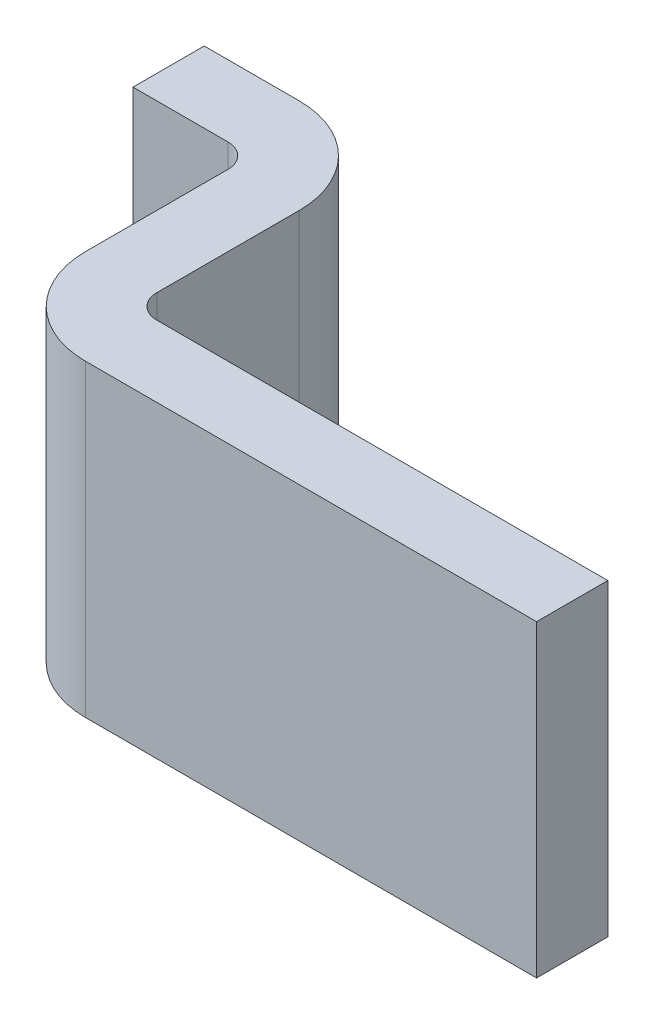
ISO-10303-21;
HEADER;
FILE_DESCRIPTION(('STEP AP214'),'2;1');
FILE_NAME('part.step','',(''),(''),'','','');
FILE_SCHEMA(('AUTOMOTIVE_DESIGN { 1 0 10303 214 1 1 1 1 }'));
ENDSEC;
DATA;
#1=APPLICATION_CONTEXT('core data for automotive mechanical design processes');
#2=APPLICATION_PROTOCOL_DEFINITION('international standard','automotive_design',2000,#1);
#3=PRODUCT_CONTEXT('',#1,'mechanical');
#4=PRODUCT('Part','Part','',(#3));
#5=PRODUCT_RELATED_PRODUCT_CATEGORY('part','',(#4));
#6=PRODUCT_DEFINITION_FORMATION('','',#4);
#7=PRODUCT_DEFINITION_CONTEXT('part definition',#1,'design');
#8=PRODUCT_DEFINITION('design','',#6,#7);
#9=PRODUCT_DEFINITION_SHAPE('','',#8);
#10=(LENGTH_UNIT() NAMED_UNIT(*) SI_UNIT(.MILLI.,.METRE.));
#11=(NAMED_UNIT(*) PLANE_ANGLE_UNIT() SI_UNIT($,.RADIAN.));
#12=(NAMED_UNIT(*) SI_UNIT($,.STERADIAN.) SOLID_ANGLE_UNIT());
#13=UNCERTAINTY_MEASURE_WITH_UNIT(LENGTH_MEASURE(1.E-05),#10,'distance_accuracy_value','');
#14=(GEOMETRIC_REPRESENTATION_CONTEXT(3) GLOBAL_UNCERTAINTY_ASSIGNED_CONTEXT((#13)) GLOBAL_UNIT_ASSIGNED_CONTEXT((#10,
#11,#12)) REPRESENTATION_CONTEXT('',''));
#15=CARTESIAN_POINT('',(0.,0.,0.));
#16=DIRECTION('',(0.,0.,1.));
#17=DIRECTION('',(1.,0.,0.));
#18=AXIS2_PLACEMENT_3D('',#15,#16,#17);
#19=CARTESIAN_POINT('',(-1.225,-0.325,0.2));
#20=DIRECTION('',(0.,-1.,0.));
#21=DIRECTION('',(0.,0.,-1.));
#22=AXIS2_PLACEMENT_3D('',#19,#20,#21);
#23=CYLINDRICAL_SURFACE('',#22,0.05);
#24=CARTESIAN_POINT('',(-1.225,-0.325,0.2));
#25=DIRECTION('',(0.,1.,0.));
#26=DIRECTION('',(0.,0.,-1.));
#27=AXIS2_PLACEMENT_3D('',#24,#25,#26);
#28=CIRCLE('',#27,0.05);
#29=CARTESIAN_POINT('',(-1.175,-0.325,0.2));
#30=VERTEX_POINT('',#29);
#31=CARTESIAN_POINT('',(-1.225,-0.325,0.15));
#32=VERTEX_POINT('',#31);
#33=EDGE_CURVE('E132',#30,#32,#28,.T.);
#34=ORIENTED_EDGE('',*,*,#33,.F.);
#35=DIRECTION('',(0.,-1.,0.));
#36=VECTOR('',#35,1.);
#37=CARTESIAN_POINT('',(-1.175,-0.325,0.2));
#38=LINE('',#37,#36);
#39=CARTESIAN_POINT('',(-1.175,0.325,0.2));
#40=VERTEX_POINT('',#39);
#41=EDGE_CURVE('E200',#40,#30,#38,.T.);
#42=ORIENTED_EDGE('',*,*,#41,.F.);
#43=CARTESIAN_POINT('',(-1.225,0.325,0.2));
#44=DIRECTION('',(0.,-1.,0.));
#45=DIRECTION('',(0.,0.,-1.));
#46=AXIS2_PLACEMENT_3D('',#43,#44,#45);
#47=CIRCLE('',#46,0.05);
#48=CARTESIAN_POINT('',(-1.225,0.325,0.15));
#49=VERTEX_POINT('',#48);
#50=EDGE_CURVE('E40',#49,#40,#47,.T.);
#51=ORIENTED_EDGE('',*,*,#50,.F.);
#52=DIRECTION('',(0.,1.,0.));
#53=VECTOR('',#52,1.);
#54=CARTESIAN_POINT('',(-1.225,0.325,0.15));
#55=LINE('',#54,#53);
#56=EDGE_CURVE('E188',#32,#49,#55,.T.);
#57=ORIENTED_EDGE('',*,*,#56,.F.);
#58=EDGE_LOOP('',(#34,#42,#51,#57));
#59=FACE_BOUND('',#58,.T.);
#60=ADVANCED_FACE('F16',(#59),#23,.F.);
#61=CARTESIAN_POINT('',(-0.975,-0.325,0.5));
#62=DIRECTION('',(0.,-1.,0.));
#63=DIRECTION('',(0.,0.,-1.));
#64=AXIS2_PLACEMENT_3D('',#61,#62,#63);
#65=CYLINDRICAL_SURFACE('',#64,0.05);
#66=CARTESIAN_POINT('',(-0.975,-0.325,0.5));
#67=DIRECTION('',(0.,1.,0.));
#68=DIRECTION('',(0.,0.,-1.));
#69=AXIS2_PLACEMENT_3D('',#66,#67,#68);
#70=CIRCLE('',#69,0.05);
#71=CARTESIAN_POINT('',(-1.025,-0.325,0.5));
#72=VERTEX_POINT('',#71);
#73=CARTESIAN_POINT('',(-0.975,-0.325,0.55));
#74=VERTEX_POINT('',#73);
#75=EDGE_CURVE('E131',#72,#74,#70,.T.);
#76=ORIENTED_EDGE('',*,*,#75,.F.);
#77=DIRECTION('',(0.,-1.,0.));
#78=VECTOR('',#77,1.);
#79=CARTESIAN_POINT('',(-1.025,-0.325,0.5));
#80=LINE('',#79,#78);
#81=CARTESIAN_POINT('',(-1.025,0.325,0.5));
#82=VERTEX_POINT('',#81);
#83=EDGE_CURVE('E145',#82,#72,#80,.T.);
#84=ORIENTED_EDGE('',*,*,#83,.F.);
#85=CARTESIAN_POINT('',(-0.975,0.325,0.5));
#86=DIRECTION('',(0.,-1.,0.));
#87=DIRECTION('',(0.,0.,-1.));
#88=AXIS2_PLACEMENT_3D('',#85,#86,#87);
#89=CIRCLE('',#88,0.05);
#90=CARTESIAN_POINT('',(-0.975,0.325,0.55));
#91=VERTEX_POINT('',#90);
#92=EDGE_CURVE('E26',#91,#82,#89,.T.);
#93=ORIENTED_EDGE('',*,*,#92,.F.);
#94=DIRECTION('',(0.,1.,0.));
#95=VECTOR('',#94,1.);
#96=CARTESIAN_POINT('',(-0.975,0.325,0.55));
#97=LINE('',#96,#95);
#98=EDGE_CURVE('E172',#74,#91,#97,.T.);
#99=ORIENTED_EDGE('',*,*,#98,.F.);
#100=EDGE_LOOP('',(#76,#84,#93,#99));
#101=FACE_BOUND('',#100,.T.);
#102=ADVANCED_FACE('F509',(#101),#65,.F.);
#103=CARTESIAN_POINT('',(-1.225,-0.325,0.2));
#104=DIRECTION('',(0.,1.,0.));
#105=DIRECTION('',(0.,0.,1.));
#106=AXIS2_PLACEMENT_3D('',#103,#104,#105);
#107=CYLINDRICAL_SURFACE('',#106,0.2);
#108=CARTESIAN_POINT('',(-1.225,-0.325,0.2));
#109=DIRECTION('',(0.,-1.,0.));
#110=DIRECTION('',(0.,0.,-1.));
#111=AXIS2_PLACEMENT_3D('',#108,#109,#110);
#112=CIRCLE('',#111,0.2);
#113=CARTESIAN_POINT('',(-1.225,-0.325,0.));
#114=VERTEX_POINT('',#113);
#115=CARTESIAN_POINT('',(-1.025,-0.325,0.2));
#116=VERTEX_POINT('',#115);
#117=EDGE_CURVE('E118',#114,#116,#112,.T.);
#118=ORIENTED_EDGE('',*,*,#117,.F.);
#119=DIRECTION('',(0.,-1.,0.));
#120=VECTOR('',#119,1.);
#121=CARTESIAN_POINT('',(-1.225,-0.325,0.));
#122=LINE('',#121,#120);
#123=CARTESIAN_POINT('',(-1.225,0.325,0.));
#124=VERTEX_POINT('',#123);
#125=EDGE_CURVE('E173',#124,#114,#122,.T.);
#126=ORIENTED_EDGE('',*,*,#125,.F.);
#127=CARTESIAN_POINT('',(-1.225,0.325,0.2));
#128=DIRECTION('',(0.,1.,0.));
#129=DIRECTION('',(0.,0.,-1.));
#130=AXIS2_PLACEMENT_3D('',#127,#128,#129);
#131=CIRCLE('',#130,0.2);
#132=CARTESIAN_POINT('',(-1.025,0.325,0.2));
#133=VERTEX_POINT('',#132);
#134=EDGE_CURVE('E11',#133,#124,#131,.T.);
#135=ORIENTED_EDGE('',*,*,#134,.F.);
#136=DIRECTION('',(0.,1.,0.));
#137=VECTOR('',#136,1.);
#138=CARTESIAN_POINT('',(-1.025,-0.325,0.2));
#139=LINE('',#138,#137);
#140=EDGE_CURVE('E135',#116,#133,#139,.T.);
#141=ORIENTED_EDGE('',*,*,#140,.F.);
#142=EDGE_LOOP('',(#118,#126,#135,#141));
#143=FACE_BOUND('',#142,.T.);
#144=ADVANCED_FACE('F136',(#143),#107,.T.);
#145=CARTESIAN_POINT('',(-0.975,-0.325,0.5));
#146=DIRECTION('',(0.,1.,0.));
#147=DIRECTION('',(0.,0.,1.));
#148=AXIS2_PLACEMENT_3D('',#145,#146,#147);
#149=CYLINDRICAL_SURFACE('',#148,0.2);
#150=CARTESIAN_POINT('',(-0.975,-0.325,0.5));
#151=DIRECTION('',(0.,-1.,0.));
#152=DIRECTION('',(0.,0.,-1.));
#153=AXIS2_PLACEMENT_3D('',#150,#151,#152);
#154=CIRCLE('',#153,0.2);
#155=CARTESIAN_POINT('',(-0.975,-0.325,0.7));
#156=VERTEX_POINT('',#155);
#157=CARTESIAN_POINT('',(-1.175,-0.325,0.5));
#158=VERTEX_POINT('',#157);
#159=EDGE_CURVE('E194',#156,#158,#154,.T.);
#160=ORIENTED_EDGE('',*,*,#159,.F.);
#161=DIRECTION('',(0.,-1.,0.));
#162=VECTOR('',#161,1.);
#163=CARTESIAN_POINT('',(-0.975,-0.325,0.7));
#164=LINE('',#163,#162);
#165=CARTESIAN_POINT('',(-0.975,0.325,0.7));
#166=VERTEX_POINT('',#165);
#167=EDGE_CURVE('E181',#166,#156,#164,.T.);
#168=ORIENTED_EDGE('',*,*,#167,.F.);
#169=CARTESIAN_POINT('',(-0.975,0.325,0.5));
#170=DIRECTION('',(0.,1.,0.));
#171=DIRECTION('',(0.,0.,-1.));
#172=AXIS2_PLACEMENT_3D('',#169,#170,#171);
#173=CIRCLE('',#172,0.2);
#174=CARTESIAN_POINT('',(-1.175,0.325,0.5));
#175=VERTEX_POINT('',#174);
#176=EDGE_CURVE('E157',#175,#166,#173,.T.);
#177=ORIENTED_EDGE('',*,*,#176,.F.);
#178=DIRECTION('',(0.,1.,0.));
#179=VECTOR('',#178,1.);
#180=CARTESIAN_POINT('',(-1.175,-0.325,0.5));
#181=LINE('',#180,#179);
#182=EDGE_CURVE('E222',#158,#175,#181,.T.);
#183=ORIENTED_EDGE('',*,*,#182,.F.);
#184=EDGE_LOOP('',(#160,#168,#177,#183));
#185=FACE_BOUND('',#184,.T.);
#186=ADVANCED_FACE('F260',(#185),#149,.T.);
#187=CARTESIAN_POINT('',(-0.725,0.325,0.35));
#188=DIRECTION('',(0.,-1.,0.));
#189=DIRECTION('',(0.,0.,-1.));
#190=AXIS2_PLACEMENT_3D('',#187,#188,#189);
#191=PLANE('',#190);
#192=DIRECTION('',(1.,0.,0.));
#193=VECTOR('',#192,1.);
#194=CARTESIAN_POINT('',(-1.3,0.325,0.15));
#195=LINE('',#194,#193);
#196=CARTESIAN_POINT('',(-1.425,0.325,0.15));
#197=VERTEX_POINT('',#196);
#198=EDGE_CURVE('E192',#197,#49,#195,.T.);
#199=ORIENTED_EDGE('',*,*,#198,.T.);
#200=ORIENTED_EDGE('',*,*,#50,.T.);
#201=DIRECTION('',(0.,0.,1.));
#202=VECTOR('',#201,1.);
#203=CARTESIAN_POINT('',(-1.175,0.325,0.425));
#204=LINE('',#203,#202);
#205=EDGE_CURVE('E180',#40,#175,#204,.T.);
#206=ORIENTED_EDGE('',*,*,#205,.T.);
#207=ORIENTED_EDGE('',*,*,#176,.T.);
#208=DIRECTION('',(1.,0.,0.));
#209=VECTOR('',#208,1.);
#210=CARTESIAN_POINT('',(-0.6,0.325,0.7));
#211=LINE('',#210,#209);
#212=CARTESIAN_POINT('',(-0.0250000000000006,0.325,0.7));
#213=VERTEX_POINT('',#212);
#214=EDGE_CURVE('E185',#166,#213,#211,.T.);
#215=ORIENTED_EDGE('',*,*,#214,.T.);
#216=DIRECTION('',(0.,0.,-1.));
#217=VECTOR('',#216,1.);
#218=CARTESIAN_POINT('',(-0.0250000000000006,0.325,0.625));
#219=LINE('',#218,#217);
#220=CARTESIAN_POINT('',(-0.0250000000000007,0.325,0.55));
#221=VERTEX_POINT('',#220);
#222=EDGE_CURVE('E213',#213,#221,#219,.T.);
#223=ORIENTED_EDGE('',*,*,#222,.T.);
#224=DIRECTION('',(-1.,0.,0.));
#225=VECTOR('',#224,1.);
#226=CARTESIAN_POINT('',(-0.525,0.325,0.55));
#227=LINE('',#226,#225);
#228=EDGE_CURVE('E214',#221,#91,#227,.T.);
#229=ORIENTED_EDGE('',*,*,#228,.T.);
#230=ORIENTED_EDGE('',*,*,#92,.T.);
#231=DIRECTION('',(0.,0.,-1.));
#232=VECTOR('',#231,1.);
#233=CARTESIAN_POINT('',(-1.025,0.325,0.275));
#234=LINE('',#233,#232);
#235=EDGE_CURVE('E152',#82,#133,#234,.T.);
#236=ORIENTED_EDGE('',*,*,#235,.T.);
#237=ORIENTED_EDGE('',*,*,#134,.T.);
#238=DIRECTION('',(-1.,0.,0.));
#239=VECTOR('',#238,1.);
#240=CARTESIAN_POINT('',(-1.225,0.325,0.));
#241=LINE('',#240,#239);
#242=CARTESIAN_POINT('',(-1.425,0.325,0.));
#243=VERTEX_POINT('',#242);
#244=EDGE_CURVE('E19',#124,#243,#241,.T.);
#245=ORIENTED_EDGE('',*,*,#244,.T.);
#246=DIRECTION('',(0.,0.,1.));
#247=VECTOR('',#246,1.);
#248=CARTESIAN_POINT('',(-1.425,0.325,0.075));
#249=LINE('',#248,#247);
#250=EDGE_CURVE('E208',#243,#197,#249,.T.);
#251=ORIENTED_EDGE('',*,*,#250,.T.);
#252=EDGE_LOOP('',(#199,#200,#206,#207,#215,#223,#229,#230,#236,#237,#245,#251));
#253=FACE_BOUND('',#252,.T.);
#254=ADVANCED_FACE('F253',(#253),#191,.F.);
#255=CARTESIAN_POINT('',(-0.725,-0.325,0.35));
#256=DIRECTION('',(0.,-1.,0.));
#257=DIRECTION('',(0.,0.,-1.));
#258=AXIS2_PLACEMENT_3D('',#255,#256,#257);
#259=PLANE('',#258);
#260=DIRECTION('',(1.,0.,0.));
#261=VECTOR('',#260,1.);
#262=CARTESIAN_POINT('',(-0.6,-0.325,0.7));
#263=LINE('',#262,#261);
#264=CARTESIAN_POINT('',(-0.0250000000000006,-0.325,0.7));
#265=VERTEX_POINT('',#264);
#266=EDGE_CURVE('E176',#156,#265,#263,.T.);
#267=ORIENTED_EDGE('',*,*,#266,.F.);
#268=ORIENTED_EDGE('',*,*,#159,.T.);
#269=DIRECTION('',(0.,0.,1.));
#270=VECTOR('',#269,1.);
#271=CARTESIAN_POINT('',(-1.175,-0.325,0.425));
#272=LINE('',#271,#270);
#273=EDGE_CURVE('E204',#30,#158,#272,.T.);
#274=ORIENTED_EDGE('',*,*,#273,.F.);
#275=ORIENTED_EDGE('',*,*,#33,.T.);
#276=DIRECTION('',(1.,0.,0.));
#277=VECTOR('',#276,1.);
#278=CARTESIAN_POINT('',(-1.3,-0.325,0.15));
#279=LINE('',#278,#277);
#280=CARTESIAN_POINT('',(-1.425,-0.325,0.15));
#281=VERTEX_POINT('',#280);
#282=EDGE_CURVE('E193',#281,#32,#279,.T.);
#283=ORIENTED_EDGE('',*,*,#282,.F.);
#284=DIRECTION('',(0.,0.,1.));
#285=VECTOR('',#284,1.);
#286=CARTESIAN_POINT('',(-1.425,-0.325,0.075));
#287=LINE('',#286,#285);
#288=CARTESIAN_POINT('',(-1.425,-0.325,0.));
#289=VERTEX_POINT('',#288);
#290=EDGE_CURVE('E163',#289,#281,#287,.T.);
#291=ORIENTED_EDGE('',*,*,#290,.F.);
#292=DIRECTION('',(-1.,0.,0.));
#293=VECTOR('',#292,1.);
#294=CARTESIAN_POINT('',(-1.225,-0.325,0.));
#295=LINE('',#294,#293);
#296=EDGE_CURVE('E126',#114,#289,#295,.T.);
#297=ORIENTED_EDGE('',*,*,#296,.F.);
#298=ORIENTED_EDGE('',*,*,#117,.T.);
#299=DIRECTION('',(0.,0.,-1.));
#300=VECTOR('',#299,1.);
#301=CARTESIAN_POINT('',(-1.025,-0.325,0.275));
#302=LINE('',#301,#300);
#303=EDGE_CURVE('E123',#72,#116,#302,.T.);
#304=ORIENTED_EDGE('',*,*,#303,.F.);
#305=ORIENTED_EDGE('',*,*,#75,.T.);
#306=DIRECTION('',(-1.,0.,0.));
#307=VECTOR('',#306,1.);
#308=CARTESIAN_POINT('',(-0.525,-0.325,0.55));
#309=LINE('',#308,#307);
#310=CARTESIAN_POINT('',(-0.0250000000000007,-0.325,0.55));
#311=VERTEX_POINT('',#310);
#312=EDGE_CURVE('E141',#311,#74,#309,.T.);
#313=ORIENTED_EDGE('',*,*,#312,.F.);
#314=DIRECTION('',(0.,0.,-1.));
#315=VECTOR('',#314,1.);
#316=CARTESIAN_POINT('',(-0.0250000000000006,-0.325,0.625));
#317=LINE('',#316,#315);
#318=EDGE_CURVE('E243',#265,#311,#317,.T.);
#319=ORIENTED_EDGE('',*,*,#318,.F.);
#320=EDGE_LOOP('',(#267,#268,#274,#275,#283,#291,#297,#298,#304,#305,#313,#319));
#321=FACE_BOUND('',#320,.T.);
#322=ADVANCED_FACE('F121',(#321),#259,.T.);
#323=CARTESIAN_POINT('',(-1.3,-0.325,0.15));
#324=DIRECTION('',(0.,0.,1.));
#325=DIRECTION('',(1.,0.,0.));
#326=AXIS2_PLACEMENT_3D('',#323,#324,#325);
#327=PLANE('',#326);
#328=ORIENTED_EDGE('',*,*,#282,.T.);
#329=ORIENTED_EDGE('',*,*,#56,.T.);
#330=ORIENTED_EDGE('',*,*,#198,.F.);
#331=DIRECTION('',(0.,1.,0.));
#332=VECTOR('',#331,1.);
#333=CARTESIAN_POINT('',(-1.425,-0.325,0.15));
#334=LINE('',#333,#332);
#335=EDGE_CURVE('E167',#281,#197,#334,.T.);
#336=ORIENTED_EDGE('',*,*,#335,.F.);
#337=EDGE_LOOP('',(#328,#329,#330,#336));
#338=FACE_BOUND('',#337,.T.);
#339=ADVANCED_FACE('F309',(#338),#327,.T.);
#340=CARTESIAN_POINT('',(-1.175,-0.325,0.425));
#341=DIRECTION('',(-1.,0.,0.));
#342=DIRECTION('',(0.,0.,1.));
#343=AXIS2_PLACEMENT_3D('',#340,#341,#342);
#344=PLANE('',#343);
#345=ORIENTED_EDGE('',*,*,#205,.F.);
#346=ORIENTED_EDGE('',*,*,#41,.T.);
#347=ORIENTED_EDGE('',*,*,#273,.T.);
#348=ORIENTED_EDGE('',*,*,#182,.T.);
#349=EDGE_LOOP('',(#345,#346,#347,#348));
#350=FACE_BOUND('',#349,.T.);
#351=ADVANCED_FACE('F256',(#350),#344,.T.);
#352=CARTESIAN_POINT('',(-0.6,-0.325,0.7));
#353=DIRECTION('',(0.,0.,1.));
#354=DIRECTION('',(1.,0.,0.));
#355=AXIS2_PLACEMENT_3D('',#352,#353,#354);
#356=PLANE('',#355);
#357=ORIENTED_EDGE('',*,*,#214,.F.);
#358=ORIENTED_EDGE('',*,*,#167,.T.);
#359=ORIENTED_EDGE('',*,*,#266,.T.);
#360=DIRECTION('',(0.,1.,0.));
#361=VECTOR('',#360,1.);
#362=CARTESIAN_POINT('',(-0.0250000000000006,-0.325,0.7));
#363=LINE('',#362,#361);
#364=EDGE_CURVE('E246',#265,#213,#363,.T.);
#365=ORIENTED_EDGE('',*,*,#364,.T.);
#366=EDGE_LOOP('',(#357,#358,#359,#365));
#367=FACE_BOUND('',#366,.T.);
#368=ADVANCED_FACE('F269',(#367),#356,.T.);
#369=CARTESIAN_POINT('',(-0.0250000000000006,-0.325,0.625));
#370=DIRECTION('',(1.,0.,0.));
#371=DIRECTION('',(0.,0.,1.));
#372=AXIS2_PLACEMENT_3D('',#369,#370,#371);
#373=PLANE('',#372);
#374=ORIENTED_EDGE('',*,*,#222,.F.);
#375=ORIENTED_EDGE('',*,*,#364,.F.);
#376=ORIENTED_EDGE('',*,*,#318,.T.);
#377=DIRECTION('',(0.,1.,0.));
#378=VECTOR('',#377,1.);
#379=CARTESIAN_POINT('',(-0.0250000000000007,-0.325,0.55));
#380=LINE('',#379,#378);
#381=EDGE_CURVE('E209',#311,#221,#380,.T.);
#382=ORIENTED_EDGE('',*,*,#381,.T.);
#383=EDGE_LOOP('',(#374,#375,#376,#382));
#384=FACE_BOUND('',#383,.T.);
#385=ADVANCED_FACE('F438',(#384),#373,.T.);
#386=CARTESIAN_POINT('',(-0.525,-0.325,0.55));
#387=DIRECTION('',(0.,0.,-1.));
#388=DIRECTION('',(0.,-1.,0.));
#389=AXIS2_PLACEMENT_3D('',#386,#387,#388);
#390=PLANE('',#389);
#391=ORIENTED_EDGE('',*,*,#312,.T.);
#392=ORIENTED_EDGE('',*,*,#98,.T.);
#393=ORIENTED_EDGE('',*,*,#228,.F.);
#394=ORIENTED_EDGE('',*,*,#381,.F.);
#395=EDGE_LOOP('',(#391,#392,#393,#394));
#396=FACE_BOUND('',#395,.T.);
#397=ADVANCED_FACE('F428',(#396),#390,.T.);
#398=CARTESIAN_POINT('',(-1.025,-0.325,0.275));
#399=DIRECTION('',(1.,0.,0.));
#400=DIRECTION('',(0.,0.,1.));
#401=AXIS2_PLACEMENT_3D('',#398,#399,#400);
#402=PLANE('',#401);
#403=ORIENTED_EDGE('',*,*,#235,.F.);
#404=ORIENTED_EDGE('',*,*,#83,.T.);
#405=ORIENTED_EDGE('',*,*,#303,.T.);
#406=ORIENTED_EDGE('',*,*,#140,.T.);
#407=EDGE_LOOP('',(#403,#404,#405,#406));
#408=FACE_BOUND('',#407,.T.);
#409=ADVANCED_FACE('F143',(#408),#402,.T.);
#410=CARTESIAN_POINT('',(-1.225,-0.325,0.));
#411=DIRECTION('',(0.,0.,-1.));
#412=DIRECTION('',(0.,-1.,0.));
#413=AXIS2_PLACEMENT_3D('',#410,#411,#412);
#414=PLANE('',#413);
#415=ORIENTED_EDGE('',*,*,#244,.F.);
#416=ORIENTED_EDGE('',*,*,#125,.T.);
#417=ORIENTED_EDGE('',*,*,#296,.T.);
#418=DIRECTION('',(0.,1.,0.));
#419=VECTOR('',#418,1.);
#420=CARTESIAN_POINT('',(-1.425,-0.325,0.));
#421=LINE('',#420,#419);
#422=EDGE_CURVE('E168',#289,#243,#421,.T.);
#423=ORIENTED_EDGE('',*,*,#422,.T.);
#424=EDGE_LOOP('',(#415,#416,#417,#423));
#425=FACE_BOUND('',#424,.T.);
#426=ADVANCED_FACE('F286',(#425),#414,.T.);
#427=CARTESIAN_POINT('',(-1.425,-0.325,0.075));
#428=DIRECTION('',(-1.,0.,0.));
#429=DIRECTION('',(0.,0.,1.));
#430=AXIS2_PLACEMENT_3D('',#427,#428,#429);
#431=PLANE('',#430);
#432=ORIENTED_EDGE('',*,*,#250,.F.);
#433=ORIENTED_EDGE('',*,*,#422,.F.);
#434=ORIENTED_EDGE('',*,*,#290,.T.);
#435=ORIENTED_EDGE('',*,*,#335,.T.);
#436=EDGE_LOOP('',(#432,#433,#434,#435));
#437=FACE_BOUND('',#436,.T.);
#438=ADVANCED_FACE('F307',(#437),#431,.T.);
#439=CLOSED_SHELL('',(#60,#102,#144,#186,#254,#322,#339,#351,#368,#385,#397,#409,#426,#438));
#440=MANIFOLD_SOLID_BREP('B1',#439);
#441=ADVANCED_BREP_SHAPE_REPRESENTATION('',(#18,#440),#14);
#442=SHAPE_DEFINITION_REPRESENTATION(#9,#441);
ENDSEC;
END-ISO-10303-21;
